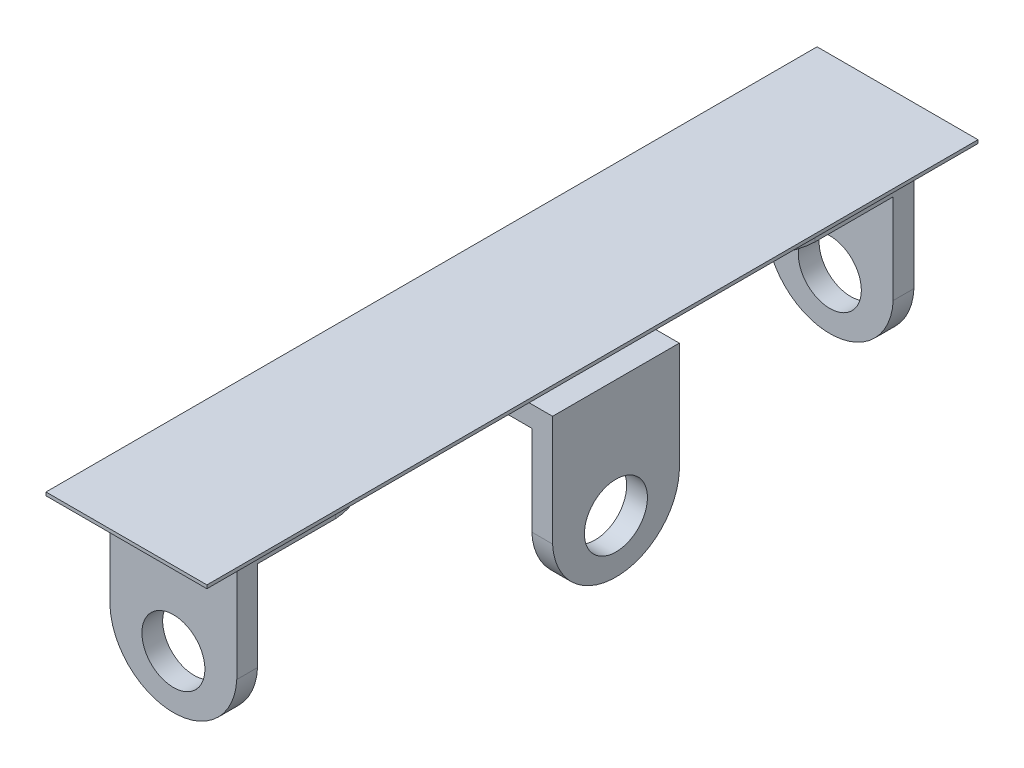
ISO-10303-21;
HEADER;
FILE_DESCRIPTION(('STEP AP214'),'2;1');
FILE_NAME('part.step','',(''),(''),'','','');
FILE_SCHEMA(('AUTOMOTIVE_DESIGN { 1 0 10303 214 1 1 1 1 }'));
ENDSEC;
DATA;
#1=APPLICATION_CONTEXT('core data for automotive mechanical design processes');
#2=APPLICATION_PROTOCOL_DEFINITION('international standard','automotive_design',2000,#1);
#3=PRODUCT_CONTEXT('',#1,'mechanical');
#4=PRODUCT('Part','Part','',(#3));
#5=PRODUCT_RELATED_PRODUCT_CATEGORY('part','',(#4));
#6=PRODUCT_DEFINITION_FORMATION('','',#4);
#7=PRODUCT_DEFINITION_CONTEXT('part definition',#1,'design');
#8=PRODUCT_DEFINITION('design','',#6,#7);
#9=PRODUCT_DEFINITION_SHAPE('','',#8);
#10=(LENGTH_UNIT() NAMED_UNIT(*) SI_UNIT(.MILLI.,.METRE.));
#11=(NAMED_UNIT(*) PLANE_ANGLE_UNIT() SI_UNIT($,.RADIAN.));
#12=(NAMED_UNIT(*) SI_UNIT($,.STERADIAN.) SOLID_ANGLE_UNIT());
#13=UNCERTAINTY_MEASURE_WITH_UNIT(LENGTH_MEASURE(1.E-05),#10,'distance_accuracy_value','');
#14=(GEOMETRIC_REPRESENTATION_CONTEXT(3) GLOBAL_UNCERTAINTY_ASSIGNED_CONTEXT((#13)) GLOBAL_UNIT_ASSIGNED_CONTEXT((#10,
#11,#12)) REPRESENTATION_CONTEXT('',''));
#15=CARTESIAN_POINT('',(0.,0.,0.));
#16=DIRECTION('',(0.,0.,1.));
#17=DIRECTION('',(1.,0.,0.));
#18=AXIS2_PLACEMENT_3D('',#15,#16,#17);
#19=CARTESIAN_POINT('',(0.,0.,0.));
#20=DIRECTION('',(0.,1.,0.));
#21=DIRECTION('',(0.,0.,1.));
#22=AXIS2_PLACEMENT_3D('',#19,#20,#21);
#23=PLANE('',#22);
#24=CARTESIAN_POINT('',(0.,0.,0.));
#25=DIRECTION('',(0.,1.,0.));
#26=DIRECTION('',(0.,0.,1.));
#27=AXIS2_PLACEMENT_3D('',#24,#25,#26);
#28=CIRCLE('',#27,2.4031575);
#29=CARTESIAN_POINT('',(-0.11715749999999,0.,-2.4003));
#30=VERTEX_POINT('',#29);
#31=CARTESIAN_POINT('',(-0.11715749999999,0.,2.4003));
#32=VERTEX_POINT('',#31);
#33=EDGE_CURVE('E324',#30,#32,#28,.T.);
#34=ORIENTED_EDGE('',*,*,#33,.T.);
#35=DIRECTION('',(1.,0.,0.));
#36=VECTOR('',#35,1.);
#37=CARTESIAN_POINT('',(-0.11715749999999,0.,2.4003));
#38=LINE('',#37,#36);
#39=CARTESIAN_POINT('',(3.048,0.,2.4003));
#40=VERTEX_POINT('',#39);
#41=EDGE_CURVE('E339',#32,#40,#38,.T.);
#42=ORIENTED_EDGE('',*,*,#41,.T.);
#43=DIRECTION('',(0.,0.,-1.));
#44=VECTOR('',#43,1.);
#45=CARTESIAN_POINT('',(3.048,0.,14.605));
#46=LINE('',#45,#44);
#47=CARTESIAN_POINT('',(3.048,0.,14.605));
#48=VERTEX_POINT('',#47);
#49=EDGE_CURVE('E365',#48,#40,#46,.T.);
#50=ORIENTED_EDGE('',*,*,#49,.F.);
#51=DIRECTION('',(1.,0.,0.));
#52=VECTOR('',#51,1.);
#53=CARTESIAN_POINT('',(-3.048,0.,14.605));
#54=LINE('',#53,#52);
#55=CARTESIAN_POINT('',(-3.048,0.,14.605));
#56=VERTEX_POINT('',#55);
#57=EDGE_CURVE('E362',#56,#48,#54,.T.);
#58=ORIENTED_EDGE('',*,*,#57,.F.);
#59=DIRECTION('',(0.,0.,1.));
#60=VECTOR('',#59,1.);
#61=CARTESIAN_POINT('',(-3.048,0.,-14.605));
#62=LINE('',#61,#60);
#63=CARTESIAN_POINT('',(-3.048,0.,-14.605));
#64=VERTEX_POINT('',#63);
#65=EDGE_CURVE('E347',#64,#56,#62,.T.);
#66=ORIENTED_EDGE('',*,*,#65,.F.);
#67=DIRECTION('',(-1.,0.,0.));
#68=VECTOR('',#67,1.);
#69=CARTESIAN_POINT('',(3.048,0.,-14.605));
#70=LINE('',#69,#68);
#71=CARTESIAN_POINT('',(3.048,0.,-14.605));
#72=VERTEX_POINT('',#71);
#73=EDGE_CURVE('E353',#72,#64,#70,.T.);
#74=ORIENTED_EDGE('',*,*,#73,.F.);
#75=CARTESIAN_POINT('',(3.048,0.,-2.4003));
#76=VERTEX_POINT('',#75);
#77=EDGE_CURVE('E364',#76,#72,#46,.T.);
#78=ORIENTED_EDGE('',*,*,#77,.F.);
#79=DIRECTION('',(-1.,0.,0.));
#80=VECTOR('',#79,1.);
#81=CARTESIAN_POINT('',(3.5404425,0.,-2.4003));
#82=LINE('',#81,#80);
#83=EDGE_CURVE('E343',#76,#30,#82,.T.);
#84=ORIENTED_EDGE('',*,*,#83,.T.);
#85=EDGE_LOOP('',(#34,#42,#50,#58,#66,#74,#78,#84));
#86=FACE_BOUND('',#85,.T.);
#87=DIRECTION('',(-1.,0.,0.));
#88=VECTOR('',#87,1.);
#89=CARTESIAN_POINT('',(2.4003,0.,12.827));
#90=LINE('',#89,#88);
#91=CARTESIAN_POINT('',(2.4003,0.,12.827));
#92=VERTEX_POINT('',#91);
#93=CARTESIAN_POINT('',(-2.4003,0.,12.827));
#94=VERTEX_POINT('',#93);
#95=EDGE_CURVE('E234',#92,#94,#90,.T.);
#96=ORIENTED_EDGE('',*,*,#95,.F.);
#97=DIRECTION('',(0.,0.,-1.));
#98=VECTOR('',#97,1.);
#99=CARTESIAN_POINT('',(2.4003,0.,12.7352425));
#100=LINE('',#99,#98);
#101=CARTESIAN_POINT('',(2.4003,0.,9.0776425));
#102=VERTEX_POINT('',#101);
#103=EDGE_CURVE('E49',#92,#102,#100,.T.);
#104=ORIENTED_EDGE('',*,*,#103,.T.);
#105=CARTESIAN_POINT('',(0.,0.,9.1948));
#106=DIRECTION('',(0.,1.,0.));
#107=DIRECTION('',(0.,0.,1.));
#108=AXIS2_PLACEMENT_3D('',#105,#106,#107);
#109=CIRCLE('',#108,2.4031575);
#110=CARTESIAN_POINT('',(-2.4003,0.,9.0776425));
#111=VERTEX_POINT('',#110);
#112=EDGE_CURVE('E294',#102,#111,#109,.T.);
#113=ORIENTED_EDGE('',*,*,#112,.T.);
#114=DIRECTION('',(0.,0.,1.));
#115=VECTOR('',#114,1.);
#116=CARTESIAN_POINT('',(-2.4003,0.,9.0776425));
#117=LINE('',#116,#115);
#118=EDGE_CURVE('E56',#111,#94,#117,.T.);
#119=ORIENTED_EDGE('',*,*,#118,.T.);
#120=EDGE_LOOP('',(#96,#104,#113,#119));
#121=FACE_BOUND('',#120,.T.);
#122=DIRECTION('',(-1.,0.,0.));
#123=VECTOR('',#122,1.);
#124=CARTESIAN_POINT('',(2.4003,0.,-12.827));
#125=LINE('',#124,#123);
#126=CARTESIAN_POINT('',(2.4003,0.,-12.827));
#127=VERTEX_POINT('',#126);
#128=CARTESIAN_POINT('',(-2.4003,0.,-12.827));
#129=VERTEX_POINT('',#128);
#130=EDGE_CURVE('E221',#127,#129,#125,.T.);
#131=ORIENTED_EDGE('',*,*,#130,.T.);
#132=DIRECTION('',(0.,0.,1.));
#133=VECTOR('',#132,1.);
#134=CARTESIAN_POINT('',(-2.4003,0.,-12.7352425));
#135=LINE('',#134,#133);
#136=CARTESIAN_POINT('',(-2.4003,0.,-9.0776425));
#137=VERTEX_POINT('',#136);
#138=EDGE_CURVE('E311',#129,#137,#135,.T.);
#139=ORIENTED_EDGE('',*,*,#138,.T.);
#140=CARTESIAN_POINT('',(0.,0.,-9.1948));
#141=DIRECTION('',(0.,1.,0.));
#142=DIRECTION('',(0.,0.,1.));
#143=AXIS2_PLACEMENT_3D('',#140,#141,#142);
#144=CIRCLE('',#143,2.4031575);
#145=CARTESIAN_POINT('',(2.4003,0.,-9.0776425));
#146=VERTEX_POINT('',#145);
#147=EDGE_CURVE('E305',#137,#146,#144,.T.);
#148=ORIENTED_EDGE('',*,*,#147,.T.);
#149=DIRECTION('',(0.,0.,-1.));
#150=VECTOR('',#149,1.);
#151=CARTESIAN_POINT('',(2.4003,0.,-9.0776425));
#152=LINE('',#151,#150);
#153=EDGE_CURVE('E319',#146,#127,#152,.T.);
#154=ORIENTED_EDGE('',*,*,#153,.T.);
#155=EDGE_LOOP('',(#131,#139,#148,#154));
#156=FACE_BOUND('',#155,.T.);
#157=ADVANCED_FACE('F34',(#86,#121,#156),#23,.F.);
#158=CARTESIAN_POINT('',(0.,-0.7874,9.1948));
#159=DIRECTION('',(0.,1.,0.));
#160=DIRECTION('',(0.,0.,1.));
#161=AXIS2_PLACEMENT_3D('',#158,#159,#160);
#162=PLANE('',#161);
#163=CARTESIAN_POINT('',(0.,-0.7874,9.1948000000002));
#164=DIRECTION('',(0.,1.,0.));
#165=DIRECTION('',(0.,0.,1.));
#166=AXIS2_PLACEMENT_3D('',#163,#164,#165);
#167=CIRCLE('',#166,1.6510000000002);
#168=CARTESIAN_POINT('',(0.,-0.7874,10.8458000000004));
#169=VERTEX_POINT('',#168);
#170=EDGE_CURVE('E11',#169,#169,#167,.F.);
#171=ORIENTED_EDGE('',*,*,#170,.F.);
#172=EDGE_LOOP('',(#171));
#173=FACE_BOUND('',#172,.T.);
#174=DIRECTION('',(1.,0.,0.));
#175=VECTOR('',#174,1.);
#176=CARTESIAN_POINT('',(0.,-0.7874,12.0396));
#177=LINE('',#176,#175);
#178=CARTESIAN_POINT('',(-2.4003,-0.7874,12.0396));
#179=VERTEX_POINT('',#178);
#180=CARTESIAN_POINT('',(2.4003,-0.7874,12.0396));
#181=VERTEX_POINT('',#180);
#182=EDGE_CURVE('E384',#179,#181,#177,.T.);
#183=ORIENTED_EDGE('',*,*,#182,.F.);
#184=DIRECTION('',(0.,0.,1.));
#185=VECTOR('',#184,1.);
#186=CARTESIAN_POINT('',(-2.4003,-0.7874,9.0776425));
#187=LINE('',#186,#185);
#188=CARTESIAN_POINT('',(-2.4003,-0.7874,9.0776425));
#189=VERTEX_POINT('',#188);
#190=EDGE_CURVE('E290',#189,#179,#187,.T.);
#191=ORIENTED_EDGE('',*,*,#190,.F.);
#192=CARTESIAN_POINT('',(0.,-0.7874,9.1948));
#193=DIRECTION('',(0.,1.,0.));
#194=DIRECTION('',(0.,0.,1.));
#195=AXIS2_PLACEMENT_3D('',#192,#193,#194);
#196=CIRCLE('',#195,2.4031575);
#197=CARTESIAN_POINT('',(2.4003,-0.7874,9.0776425));
#198=VERTEX_POINT('',#197);
#199=EDGE_CURVE('E296',#198,#189,#196,.T.);
#200=ORIENTED_EDGE('',*,*,#199,.F.);
#201=DIRECTION('',(0.,0.,-1.));
#202=VECTOR('',#201,1.);
#203=CARTESIAN_POINT('',(2.4003,-0.7874,12.7352425));
#204=LINE('',#203,#202);
#205=EDGE_CURVE('E293',#181,#198,#204,.T.);
#206=ORIENTED_EDGE('',*,*,#205,.F.);
#207=EDGE_LOOP('',(#183,#191,#200,#206));
#208=FACE_BOUND('',#207,.T.);
#209=ADVANCED_FACE('F423',(#173,#208),#162,.F.);
#210=CARTESIAN_POINT('',(0.,-0.7874,0.));
#211=DIRECTION('',(0.,1.,0.));
#212=DIRECTION('',(0.,0.,1.));
#213=AXIS2_PLACEMENT_3D('',#210,#211,#212);
#214=PLANE('',#213);
#215=CARTESIAN_POINT('',(-1.21430643318376E-13,-0.7874,0.));
#216=DIRECTION('',(0.,1.,0.));
#217=DIRECTION('',(0.,0.,1.));
#218=AXIS2_PLACEMENT_3D('',#215,#216,#217);
#219=CIRCLE('',#218,1.65100000000012);
#220=CARTESIAN_POINT('',(-1.21430643318376E-13,-0.7874,1.65100000000012));
#221=VERTEX_POINT('',#220);
#222=EDGE_CURVE('E388',#221,#221,#219,.F.);
#223=ORIENTED_EDGE('',*,*,#222,.F.);
#224=EDGE_LOOP('',(#223));
#225=FACE_BOUND('',#224,.T.);
#226=DIRECTION('',(0.,0.,-1.));
#227=VECTOR('',#226,1.);
#228=CARTESIAN_POINT('',(3.1496,-0.7874,0.));
#229=LINE('',#228,#227);
#230=CARTESIAN_POINT('',(3.1496,-0.7874,2.4003));
#231=VERTEX_POINT('',#230);
#232=CARTESIAN_POINT('',(3.1496,-0.7874,-2.4003));
#233=VERTEX_POINT('',#232);
#234=EDGE_CURVE('E381',#231,#233,#229,.T.);
#235=ORIENTED_EDGE('',*,*,#234,.F.);
#236=DIRECTION('',(1.,0.,0.));
#237=VECTOR('',#236,1.);
#238=CARTESIAN_POINT('',(-0.11715749999999,-0.7874,2.4003));
#239=LINE('',#238,#237);
#240=CARTESIAN_POINT('',(-0.11715749999999,-0.7874,2.4003));
#241=VERTEX_POINT('',#240);
#242=EDGE_CURVE('E329',#241,#231,#239,.T.);
#243=ORIENTED_EDGE('',*,*,#242,.F.);
#244=CARTESIAN_POINT('',(0.,-0.7874,0.));
#245=DIRECTION('',(0.,1.,0.));
#246=DIRECTION('',(0.,0.,1.));
#247=AXIS2_PLACEMENT_3D('',#244,#245,#246);
#248=CIRCLE('',#247,2.4031575);
#249=CARTESIAN_POINT('',(-0.11715749999999,-0.7874,-2.4003));
#250=VERTEX_POINT('',#249);
#251=EDGE_CURVE('E326',#250,#241,#248,.T.);
#252=ORIENTED_EDGE('',*,*,#251,.F.);
#253=DIRECTION('',(-1.,0.,0.));
#254=VECTOR('',#253,1.);
#255=CARTESIAN_POINT('',(3.5404425,-0.7874,-2.4003));
#256=LINE('',#255,#254);
#257=EDGE_CURVE('E333',#233,#250,#256,.T.);
#258=ORIENTED_EDGE('',*,*,#257,.F.);
#259=EDGE_LOOP('',(#235,#243,#252,#258));
#260=FACE_BOUND('',#259,.T.);
#261=ADVANCED_FACE('F429',(#225,#260),#214,.F.);
#262=CARTESIAN_POINT('',(-3.048,0.127,-14.605));
#263=DIRECTION('',(1.,0.,0.));
#264=DIRECTION('',(0.,0.,-1.));
#265=AXIS2_PLACEMENT_3D('',#262,#263,#264);
#266=PLANE('',#265);
#267=ORIENTED_EDGE('',*,*,#65,.T.);
#268=DIRECTION('',(0.,-1.,0.));
#269=VECTOR('',#268,1.);
#270=CARTESIAN_POINT('',(-3.048,0.127,14.605));
#271=LINE('',#270,#269);
#272=CARTESIAN_POINT('',(-3.048,0.127,14.605));
#273=VERTEX_POINT('',#272);
#274=EDGE_CURVE('E378',#273,#56,#271,.T.);
#275=ORIENTED_EDGE('',*,*,#274,.F.);
#276=DIRECTION('',(0.,0.,1.));
#277=VECTOR('',#276,1.);
#278=CARTESIAN_POINT('',(-3.048,0.127,-14.605));
#279=LINE('',#278,#277);
#280=CARTESIAN_POINT('',(-3.048,0.127,-14.605));
#281=VERTEX_POINT('',#280);
#282=EDGE_CURVE('E349',#281,#273,#279,.T.);
#283=ORIENTED_EDGE('',*,*,#282,.F.);
#284=DIRECTION('',(0.,-1.,0.));
#285=VECTOR('',#284,1.);
#286=CARTESIAN_POINT('',(-3.048,0.127,-14.605));
#287=LINE('',#286,#285);
#288=EDGE_CURVE('E359',#281,#64,#287,.T.);
#289=ORIENTED_EDGE('',*,*,#288,.T.);
#290=EDGE_LOOP('',(#267,#275,#283,#289));
#291=FACE_BOUND('',#290,.T.);
#292=ADVANCED_FACE('F36',(#291),#266,.F.);
#293=CARTESIAN_POINT('',(-3.048,0.127,14.605));
#294=DIRECTION('',(0.,0.,-1.));
#295=DIRECTION('',(-1.,0.,0.));
#296=AXIS2_PLACEMENT_3D('',#293,#294,#295);
#297=PLANE('',#296);
#298=ORIENTED_EDGE('',*,*,#57,.T.);
#299=DIRECTION('',(0.,-1.,0.));
#300=VECTOR('',#299,1.);
#301=CARTESIAN_POINT('',(3.048,0.127,14.605));
#302=LINE('',#301,#300);
#303=CARTESIAN_POINT('',(3.048,0.127,14.605));
#304=VERTEX_POINT('',#303);
#305=EDGE_CURVE('E375',#304,#48,#302,.T.);
#306=ORIENTED_EDGE('',*,*,#305,.F.);
#307=DIRECTION('',(1.,0.,0.));
#308=VECTOR('',#307,1.);
#309=CARTESIAN_POINT('',(-3.048,0.127,14.605));
#310=LINE('',#309,#308);
#311=EDGE_CURVE('E352',#273,#304,#310,.T.);
#312=ORIENTED_EDGE('',*,*,#311,.F.);
#313=ORIENTED_EDGE('',*,*,#274,.T.);
#314=EDGE_LOOP('',(#298,#306,#312,#313));
#315=FACE_BOUND('',#314,.T.);
#316=ADVANCED_FACE('F442',(#315),#297,.F.);
#317=CARTESIAN_POINT('',(3.048,0.127,14.605));
#318=DIRECTION('',(-1.,0.,0.));
#319=DIRECTION('',(0.,0.,1.));
#320=AXIS2_PLACEMENT_3D('',#317,#318,#319);
#321=PLANE('',#320);
#322=ORIENTED_EDGE('',*,*,#49,.T.);
#323=EDGE_CURVE('E368',#40,#76,#46,.T.);
#324=ORIENTED_EDGE('',*,*,#323,.T.);
#325=ORIENTED_EDGE('',*,*,#77,.T.);
#326=DIRECTION('',(0.,-1.,0.));
#327=VECTOR('',#326,1.);
#328=CARTESIAN_POINT('',(3.048,0.127,-14.605));
#329=LINE('',#328,#327);
#330=CARTESIAN_POINT('',(3.048,0.127,-14.605));
#331=VERTEX_POINT('',#330);
#332=EDGE_CURVE('E372',#331,#72,#329,.T.);
#333=ORIENTED_EDGE('',*,*,#332,.F.);
#334=DIRECTION('',(0.,0.,-1.));
#335=VECTOR('',#334,1.);
#336=CARTESIAN_POINT('',(3.048,0.127,14.605));
#337=LINE('',#336,#335);
#338=EDGE_CURVE('E355',#304,#331,#337,.T.);
#339=ORIENTED_EDGE('',*,*,#338,.F.);
#340=ORIENTED_EDGE('',*,*,#305,.T.);
#341=EDGE_LOOP('',(#322,#324,#325,#333,#339,#340));
#342=FACE_BOUND('',#341,.T.);
#343=ADVANCED_FACE('F439',(#342),#321,.F.);
#344=CARTESIAN_POINT('',(3.048,0.127,-14.605));
#345=DIRECTION('',(0.,0.,1.));
#346=DIRECTION('',(1.,0.,0.));
#347=AXIS2_PLACEMENT_3D('',#344,#345,#346);
#348=PLANE('',#347);
#349=ORIENTED_EDGE('',*,*,#73,.T.);
#350=ORIENTED_EDGE('',*,*,#288,.F.);
#351=DIRECTION('',(-1.,0.,0.));
#352=VECTOR('',#351,1.);
#353=CARTESIAN_POINT('',(3.048,0.127,-14.605));
#354=LINE('',#353,#352);
#355=EDGE_CURVE('E357',#331,#281,#354,.T.);
#356=ORIENTED_EDGE('',*,*,#355,.F.);
#357=ORIENTED_EDGE('',*,*,#332,.T.);
#358=EDGE_LOOP('',(#349,#350,#356,#357));
#359=FACE_BOUND('',#358,.T.);
#360=ADVANCED_FACE('F436',(#359),#348,.F.);
#361=CARTESIAN_POINT('',(0.,0.127,0.));
#362=DIRECTION('',(0.,1.,0.));
#363=DIRECTION('',(0.,0.,1.));
#364=AXIS2_PLACEMENT_3D('',#361,#362,#363);
#365=PLANE('',#364);
#366=ORIENTED_EDGE('',*,*,#282,.T.);
#367=ORIENTED_EDGE('',*,*,#311,.T.);
#368=ORIENTED_EDGE('',*,*,#338,.T.);
#369=ORIENTED_EDGE('',*,*,#355,.T.);
#370=EDGE_LOOP('',(#366,#367,#368,#369));
#371=FACE_BOUND('',#370,.T.);
#372=ADVANCED_FACE('F434',(#371),#365,.T.);
#373=CARTESIAN_POINT('',(0.,0.,0.));
#374=DIRECTION('',(0.,1.,0.));
#375=DIRECTION('',(0.,0.,1.));
#376=AXIS2_PLACEMENT_3D('',#373,#374,#375);
#377=PLANE('',#376);
#378=CARTESIAN_POINT('',(3.937,0.,-2.4003));
#379=VERTEX_POINT('',#378);
#380=EDGE_CURVE('E330',#379,#76,#82,.T.);
#381=ORIENTED_EDGE('',*,*,#380,.T.);
#382=ORIENTED_EDGE('',*,*,#323,.F.);
#383=CARTESIAN_POINT('',(3.937,0.,2.4003));
#384=VERTEX_POINT('',#383);
#385=EDGE_CURVE('E338',#40,#384,#38,.T.);
#386=ORIENTED_EDGE('',*,*,#385,.T.);
#387=DIRECTION('',(0.,0.,1.));
#388=VECTOR('',#387,1.);
#389=CARTESIAN_POINT('',(3.937,0.,-2.4003));
#390=LINE('',#389,#388);
#391=EDGE_CURVE('E264',#379,#384,#390,.T.);
#392=ORIENTED_EDGE('',*,*,#391,.F.);
#393=EDGE_LOOP('',(#381,#382,#386,#392));
#394=FACE_BOUND('',#393,.T.);
#395=ADVANCED_FACE('F466',(#394),#377,.T.);
#396=CARTESIAN_POINT('',(0.,-0.7874,0.));
#397=DIRECTION('',(0.,1.,0.));
#398=DIRECTION('',(0.,0.,1.));
#399=AXIS2_PLACEMENT_3D('',#396,#397,#398);
#400=CYLINDRICAL_SURFACE('',#399,2.4031575);
#401=ORIENTED_EDGE('',*,*,#33,.F.);
#402=DIRECTION('',(0.,1.,0.));
#403=VECTOR('',#402,1.);
#404=CARTESIAN_POINT('',(-0.11715749999999,-0.7874,-2.4003));
#405=LINE('',#404,#403);
#406=EDGE_CURVE('E344',#250,#30,#405,.T.);
#407=ORIENTED_EDGE('',*,*,#406,.F.);
#408=ORIENTED_EDGE('',*,*,#251,.T.);
#409=DIRECTION('',(0.,1.,0.));
#410=VECTOR('',#409,1.);
#411=CARTESIAN_POINT('',(-0.11715749999999,-0.7874,2.4003));
#412=LINE('',#411,#410);
#413=EDGE_CURVE('E335',#241,#32,#412,.T.);
#414=ORIENTED_EDGE('',*,*,#413,.T.);
#415=EDGE_LOOP('',(#401,#407,#408,#414));
#416=FACE_BOUND('',#415,.T.);
#417=ADVANCED_FACE('F478',(#416),#400,.T.);
#418=CARTESIAN_POINT('',(3.5404425,-0.7874,-2.4003));
#419=DIRECTION('',(0.,0.,-1.));
#420=DIRECTION('',(-1.,0.,0.));
#421=AXIS2_PLACEMENT_3D('',#418,#419,#420);
#422=PLANE('',#421);
#423=ORIENTED_EDGE('',*,*,#380,.F.);
#424=DIRECTION('',(0.,1.,0.));
#425=VECTOR('',#424,1.);
#426=CARTESIAN_POINT('',(3.937,-4.191,-2.4003));
#427=LINE('',#426,#425);
#428=CARTESIAN_POINT('',(3.937,-4.191,-2.4003));
#429=VERTEX_POINT('',#428);
#430=EDGE_CURVE('E270',#429,#379,#427,.T.);
#431=ORIENTED_EDGE('',*,*,#430,.F.);
#432=DIRECTION('',(1.,0.,0.));
#433=VECTOR('',#432,1.);
#434=CARTESIAN_POINT('',(3.1496,-4.191,-2.4003));
#435=LINE('',#434,#433);
#436=CARTESIAN_POINT('',(3.1496,-4.191,-2.4003));
#437=VERTEX_POINT('',#436);
#438=EDGE_CURVE('E287',#437,#429,#435,.T.);
#439=ORIENTED_EDGE('',*,*,#438,.F.);
#440=DIRECTION('',(0.,1.,0.));
#441=VECTOR('',#440,1.);
#442=CARTESIAN_POINT('',(3.1496,-4.191,-2.4003));
#443=LINE('',#442,#441);
#444=EDGE_CURVE('E273',#437,#233,#443,.T.);
#445=ORIENTED_EDGE('',*,*,#444,.T.);
#446=ORIENTED_EDGE('',*,*,#257,.T.);
#447=ORIENTED_EDGE('',*,*,#406,.T.);
#448=ORIENTED_EDGE('',*,*,#83,.F.);
#449=EDGE_LOOP('',(#423,#431,#439,#445,#446,#447,#448));
#450=FACE_BOUND('',#449,.T.);
#451=ADVANCED_FACE('F483',(#450),#422,.T.);
#452=CARTESIAN_POINT('',(-0.11715749999999,-0.7874,2.4003));
#453=DIRECTION('',(0.,0.,1.));
#454=DIRECTION('',(1.,0.,0.));
#455=AXIS2_PLACEMENT_3D('',#452,#453,#454);
#456=PLANE('',#455);
#457=DIRECTION('',(0.,-1.,0.));
#458=VECTOR('',#457,1.);
#459=CARTESIAN_POINT('',(3.937,0.,2.4003));
#460=LINE('',#459,#458);
#461=CARTESIAN_POINT('',(3.937,-4.191,2.4003));
#462=VERTEX_POINT('',#461);
#463=EDGE_CURVE('E279',#384,#462,#460,.T.);
#464=ORIENTED_EDGE('',*,*,#463,.F.);
#465=ORIENTED_EDGE('',*,*,#385,.F.);
#466=ORIENTED_EDGE('',*,*,#41,.F.);
#467=ORIENTED_EDGE('',*,*,#413,.F.);
#468=ORIENTED_EDGE('',*,*,#242,.T.);
#469=DIRECTION('',(0.,-1.,0.));
#470=VECTOR('',#469,1.);
#471=CARTESIAN_POINT('',(3.1496,0.,2.4003));
#472=LINE('',#471,#470);
#473=CARTESIAN_POINT('',(3.1496,-4.191,2.4003));
#474=VERTEX_POINT('',#473);
#475=EDGE_CURVE('E267',#231,#474,#472,.T.);
#476=ORIENTED_EDGE('',*,*,#475,.T.);
#477=DIRECTION('',(1.,0.,0.));
#478=VECTOR('',#477,1.);
#479=CARTESIAN_POINT('',(3.1496,-4.191,2.4003));
#480=LINE('',#479,#478);
#481=EDGE_CURVE('E276',#474,#462,#480,.T.);
#482=ORIENTED_EDGE('',*,*,#481,.T.);
#483=EDGE_LOOP('',(#464,#465,#466,#467,#468,#476,#482));
#484=FACE_BOUND('',#483,.T.);
#485=ADVANCED_FACE('F462',(#484),#456,.T.);
#486=CARTESIAN_POINT('',(0.,-0.7874,-9.1948));
#487=DIRECTION('',(0.,1.,0.));
#488=DIRECTION('',(0.,0.,1.));
#489=AXIS2_PLACEMENT_3D('',#486,#487,#488);
#490=CYLINDRICAL_SURFACE('',#489,2.4031575);
#491=ORIENTED_EDGE('',*,*,#147,.F.);
#492=DIRECTION('',(0.,1.,0.));
#493=VECTOR('',#492,1.);
#494=CARTESIAN_POINT('',(-2.4003,-0.7874,-9.0776425));
#495=LINE('',#494,#493);
#496=CARTESIAN_POINT('',(-2.4003,-0.7874,-9.0776425));
#497=VERTEX_POINT('',#496);
#498=EDGE_CURVE('E322',#497,#137,#495,.T.);
#499=ORIENTED_EDGE('',*,*,#498,.F.);
#500=CARTESIAN_POINT('',(0.,-0.7874,-9.1948));
#501=DIRECTION('',(0.,1.,0.));
#502=DIRECTION('',(0.,0.,1.));
#503=AXIS2_PLACEMENT_3D('',#500,#501,#502);
#504=CIRCLE('',#503,2.4031575);
#505=CARTESIAN_POINT('',(2.4003,-0.7874,-9.0776425));
#506=VERTEX_POINT('',#505);
#507=EDGE_CURVE('E307',#497,#506,#504,.T.);
#508=ORIENTED_EDGE('',*,*,#507,.T.);
#509=DIRECTION('',(0.,1.,0.));
#510=VECTOR('',#509,1.);
#511=CARTESIAN_POINT('',(2.4003,-0.7874,-9.0776425));
#512=LINE('',#511,#510);
#513=EDGE_CURVE('E316',#506,#146,#512,.T.);
#514=ORIENTED_EDGE('',*,*,#513,.T.);
#515=EDGE_LOOP('',(#491,#499,#508,#514));
#516=FACE_BOUND('',#515,.T.);
#517=ADVANCED_FACE('F406',(#516),#490,.T.);
#518=CARTESIAN_POINT('',(-2.4003,-0.7874,-12.7352425));
#519=DIRECTION('',(-1.,0.,0.));
#520=DIRECTION('',(0.,0.,1.));
#521=AXIS2_PLACEMENT_3D('',#518,#519,#520);
#522=PLANE('',#521);
#523=ORIENTED_EDGE('',*,*,#498,.T.);
#524=ORIENTED_EDGE('',*,*,#138,.F.);
#525=DIRECTION('',(0.,-1.,0.));
#526=VECTOR('',#525,1.);
#527=CARTESIAN_POINT('',(-2.4003,0.,-12.827));
#528=LINE('',#527,#526);
#529=CARTESIAN_POINT('',(-2.4003,-4.191,-12.827));
#530=VERTEX_POINT('',#529);
#531=EDGE_CURVE('E207',#129,#530,#528,.T.);
#532=ORIENTED_EDGE('',*,*,#531,.T.);
#533=DIRECTION('',(0.,0.,-1.));
#534=VECTOR('',#533,1.);
#535=CARTESIAN_POINT('',(-2.4003,-4.191,-12.0396));
#536=LINE('',#535,#534);
#537=CARTESIAN_POINT('',(-2.4003,-4.191,-12.0396));
#538=VERTEX_POINT('',#537);
#539=EDGE_CURVE('E203',#538,#530,#536,.T.);
#540=ORIENTED_EDGE('',*,*,#539,.F.);
#541=DIRECTION('',(0.,-1.,0.));
#542=VECTOR('',#541,1.);
#543=CARTESIAN_POINT('',(-2.4003,0.,-12.0396));
#544=LINE('',#543,#542);
#545=CARTESIAN_POINT('',(-2.4003,-0.7874,-12.0396));
#546=VERTEX_POINT('',#545);
#547=EDGE_CURVE('E190',#546,#538,#544,.T.);
#548=ORIENTED_EDGE('',*,*,#547,.F.);
#549=DIRECTION('',(0.,0.,1.));
#550=VECTOR('',#549,1.);
#551=CARTESIAN_POINT('',(-2.4003,-0.7874,-12.7352425));
#552=LINE('',#551,#550);
#553=EDGE_CURVE('E314',#546,#497,#552,.T.);
#554=ORIENTED_EDGE('',*,*,#553,.T.);
#555=EDGE_LOOP('',(#523,#524,#532,#540,#548,#554));
#556=FACE_BOUND('',#555,.T.);
#557=ADVANCED_FACE('F205',(#556),#522,.T.);
#558=CARTESIAN_POINT('',(2.4003,-0.7874,-9.0776425));
#559=DIRECTION('',(1.,0.,0.));
#560=DIRECTION('',(0.,0.,-1.));
#561=AXIS2_PLACEMENT_3D('',#558,#559,#560);
#562=PLANE('',#561);
#563=DIRECTION('',(0.,1.,0.));
#564=VECTOR('',#563,1.);
#565=CARTESIAN_POINT('',(2.4003,-4.191,-12.827));
#566=LINE('',#565,#564);
#567=CARTESIAN_POINT('',(2.4003,-4.191,-12.827));
#568=VERTEX_POINT('',#567);
#569=EDGE_CURVE('E200',#568,#127,#566,.T.);
#570=ORIENTED_EDGE('',*,*,#569,.T.);
#571=ORIENTED_EDGE('',*,*,#153,.F.);
#572=ORIENTED_EDGE('',*,*,#513,.F.);
#573=DIRECTION('',(0.,0.,-1.));
#574=VECTOR('',#573,1.);
#575=CARTESIAN_POINT('',(2.4003,-0.7874,-9.0776425));
#576=LINE('',#575,#574);
#577=CARTESIAN_POINT('',(2.4003,-0.7874,-12.0396));
#578=VERTEX_POINT('',#577);
#579=EDGE_CURVE('E310',#506,#578,#576,.T.);
#580=ORIENTED_EDGE('',*,*,#579,.T.);
#581=DIRECTION('',(0.,1.,0.));
#582=VECTOR('',#581,1.);
#583=CARTESIAN_POINT('',(2.4003,-4.191,-12.0396));
#584=LINE('',#583,#582);
#585=CARTESIAN_POINT('',(2.4003,-4.191,-12.0396));
#586=VERTEX_POINT('',#585);
#587=EDGE_CURVE('E216',#586,#578,#584,.T.);
#588=ORIENTED_EDGE('',*,*,#587,.F.);
#589=DIRECTION('',(0.,0.,-1.));
#590=VECTOR('',#589,1.);
#591=CARTESIAN_POINT('',(2.4003,-4.191,-12.0396));
#592=LINE('',#591,#590);
#593=EDGE_CURVE('E211',#586,#568,#592,.T.);
#594=ORIENTED_EDGE('',*,*,#593,.T.);
#595=EDGE_LOOP('',(#570,#571,#572,#580,#588,#594));
#596=FACE_BOUND('',#595,.T.);
#597=ADVANCED_FACE('F399',(#596),#562,.T.);
#598=CARTESIAN_POINT('',(0.,-0.7874,-9.1948));
#599=DIRECTION('',(0.,1.,0.));
#600=DIRECTION('',(0.,0.,1.));
#601=AXIS2_PLACEMENT_3D('',#598,#599,#600);
#602=PLANE('',#601);
#603=CARTESIAN_POINT('',(0.,-0.7874,-9.19479999999902));
#604=DIRECTION('',(0.,1.,0.));
#605=DIRECTION('',(0.,0.,1.));
#606=AXIS2_PLACEMENT_3D('',#603,#604,#605);
#607=CIRCLE('',#606,1.65100000000097);
#608=CARTESIAN_POINT('',(0.,-0.7874,-7.54379999999805));
#609=VERTEX_POINT('',#608);
#610=EDGE_CURVE('E42',#609,#609,#607,.F.);
#611=ORIENTED_EDGE('',*,*,#610,.F.);
#612=EDGE_LOOP('',(#611));
#613=FACE_BOUND('',#612,.T.);
#614=ORIENTED_EDGE('',*,*,#553,.F.);
#615=DIRECTION('',(1.,0.,0.));
#616=VECTOR('',#615,1.);
#617=CARTESIAN_POINT('',(0.,-0.7874,-12.0396));
#618=LINE('',#617,#616);
#619=EDGE_CURVE('E197',#546,#578,#618,.T.);
#620=ORIENTED_EDGE('',*,*,#619,.T.);
#621=ORIENTED_EDGE('',*,*,#579,.F.);
#622=ORIENTED_EDGE('',*,*,#507,.F.);
#623=EDGE_LOOP('',(#614,#620,#621,#622));
#624=FACE_BOUND('',#623,.T.);
#625=ADVANCED_FACE('F395',(#613,#624),#602,.F.);
#626=CARTESIAN_POINT('',(-2.4003,-0.7874,9.0776425));
#627=DIRECTION('',(-1.,0.,0.));
#628=DIRECTION('',(0.,0.,1.));
#629=AXIS2_PLACEMENT_3D('',#626,#627,#628);
#630=PLANE('',#629);
#631=DIRECTION('',(0.,-1.,0.));
#632=VECTOR('',#631,1.);
#633=CARTESIAN_POINT('',(-2.4003,0.,12.827));
#634=LINE('',#633,#632);
#635=CARTESIAN_POINT('',(-2.4003,-4.191,12.827));
#636=VERTEX_POINT('',#635);
#637=EDGE_CURVE('E249',#94,#636,#634,.T.);
#638=ORIENTED_EDGE('',*,*,#637,.F.);
#639=ORIENTED_EDGE('',*,*,#118,.F.);
#640=DIRECTION('',(0.,1.,0.));
#641=VECTOR('',#640,1.);
#642=CARTESIAN_POINT('',(-2.4003,-0.7874,9.0776425));
#643=LINE('',#642,#641);
#644=EDGE_CURVE('E303',#189,#111,#643,.T.);
#645=ORIENTED_EDGE('',*,*,#644,.F.);
#646=ORIENTED_EDGE('',*,*,#190,.T.);
#647=DIRECTION('',(0.,-1.,0.));
#648=VECTOR('',#647,1.);
#649=CARTESIAN_POINT('',(-2.4003,0.,12.0396));
#650=LINE('',#649,#648);
#651=CARTESIAN_POINT('',(-2.4003,-4.191,12.0396));
#652=VERTEX_POINT('',#651);
#653=EDGE_CURVE('E237',#179,#652,#650,.T.);
#654=ORIENTED_EDGE('',*,*,#653,.T.);
#655=DIRECTION('',(0.,0.,1.));
#656=VECTOR('',#655,1.);
#657=CARTESIAN_POINT('',(-2.4003,-4.191,12.0396));
#658=LINE('',#657,#656);
#659=EDGE_CURVE('E246',#652,#636,#658,.T.);
#660=ORIENTED_EDGE('',*,*,#659,.T.);
#661=EDGE_LOOP('',(#638,#639,#645,#646,#654,#660));
#662=FACE_BOUND('',#661,.T.);
#663=ADVANCED_FACE('F398',(#662),#630,.T.);
#664=CARTESIAN_POINT('',(0.,-0.7874,9.1948));
#665=DIRECTION('',(0.,1.,0.));
#666=DIRECTION('',(0.,0.,1.));
#667=AXIS2_PLACEMENT_3D('',#664,#665,#666);
#668=CYLINDRICAL_SURFACE('',#667,2.4031575);
#669=ORIENTED_EDGE('',*,*,#112,.F.);
#670=DIRECTION('',(0.,1.,0.));
#671=VECTOR('',#670,1.);
#672=CARTESIAN_POINT('',(2.4003,-0.7874,9.0776425));
#673=LINE('',#672,#671);
#674=EDGE_CURVE('E299',#198,#102,#673,.T.);
#675=ORIENTED_EDGE('',*,*,#674,.F.);
#676=ORIENTED_EDGE('',*,*,#199,.T.);
#677=ORIENTED_EDGE('',*,*,#644,.T.);
#678=EDGE_LOOP('',(#669,#675,#676,#677));
#679=FACE_BOUND('',#678,.T.);
#680=ADVANCED_FACE('F638',(#679),#668,.T.);
#681=CARTESIAN_POINT('',(2.4003,-0.7874,12.7352425));
#682=DIRECTION('',(1.,0.,0.));
#683=DIRECTION('',(0.,0.,-1.));
#684=AXIS2_PLACEMENT_3D('',#681,#682,#683);
#685=PLANE('',#684);
#686=ORIENTED_EDGE('',*,*,#103,.F.);
#687=DIRECTION('',(0.,1.,0.));
#688=VECTOR('',#687,1.);
#689=CARTESIAN_POINT('',(2.4003,-4.191,12.827));
#690=LINE('',#689,#688);
#691=CARTESIAN_POINT('',(2.4003,-4.191,12.827));
#692=VERTEX_POINT('',#691);
#693=EDGE_CURVE('E240',#692,#92,#690,.T.);
#694=ORIENTED_EDGE('',*,*,#693,.F.);
#695=DIRECTION('',(0.,0.,1.));
#696=VECTOR('',#695,1.);
#697=CARTESIAN_POINT('',(2.4003,-4.191,12.0396));
#698=LINE('',#697,#696);
#699=CARTESIAN_POINT('',(2.4003,-4.191,12.0396));
#700=VERTEX_POINT('',#699);
#701=EDGE_CURVE('E257',#700,#692,#698,.T.);
#702=ORIENTED_EDGE('',*,*,#701,.F.);
#703=DIRECTION('',(0.,1.,0.));
#704=VECTOR('',#703,1.);
#705=CARTESIAN_POINT('',(2.4003,-4.191,12.0396));
#706=LINE('',#705,#704);
#707=EDGE_CURVE('E243',#700,#181,#706,.T.);
#708=ORIENTED_EDGE('',*,*,#707,.T.);
#709=ORIENTED_EDGE('',*,*,#205,.T.);
#710=ORIENTED_EDGE('',*,*,#674,.T.);
#711=EDGE_LOOP('',(#686,#694,#702,#708,#709,#710));
#712=FACE_BOUND('',#711,.T.);
#713=ADVANCED_FACE('F630',(#712),#685,.T.);
#714=CARTESIAN_POINT('',(3.1496,-4.0738425,0.));
#715=DIRECTION('',(1.,0.,0.));
#716=DIRECTION('',(0.,0.,-1.));
#717=AXIS2_PLACEMENT_3D('',#714,#715,#716);
#718=PLANE('',#717);
#719=CARTESIAN_POINT('',(3.1496,-4.4577,0.));
#720=DIRECTION('',(1.,0.,0.));
#721=DIRECTION('',(0.,0.,-1.));
#722=AXIS2_PLACEMENT_3D('',#719,#720,#721);
#723=CIRCLE('',#722,1.1938);
#724=CARTESIAN_POINT('',(3.1496,-4.4577,-1.1938));
#725=VERTEX_POINT('',#724);
#726=EDGE_CURVE('E261',#725,#725,#723,.T.);
#727=ORIENTED_EDGE('',*,*,#726,.T.);
#728=EDGE_LOOP('',(#727));
#729=FACE_BOUND('',#728,.T.);
#730=ORIENTED_EDGE('',*,*,#475,.F.);
#731=ORIENTED_EDGE('',*,*,#234,.T.);
#732=ORIENTED_EDGE('',*,*,#444,.F.);
#733=CARTESIAN_POINT('',(3.1496,-4.0738425,0.));
#734=DIRECTION('',(1.,0.,0.));
#735=DIRECTION('',(0.,0.,-1.));
#736=AXIS2_PLACEMENT_3D('',#733,#734,#735);
#737=CIRCLE('',#736,2.4031575);
#738=EDGE_CURVE('E269',#474,#437,#737,.T.);
#739=ORIENTED_EDGE('',*,*,#738,.F.);
#740=EDGE_LOOP('',(#730,#731,#732,#739));
#741=FACE_BOUND('',#740,.T.);
#742=ADVANCED_FACE('F626',(#729,#741),#718,.F.);
#743=CARTESIAN_POINT('',(3.1496,-4.0738425,0.));
#744=DIRECTION('',(1.,0.,0.));
#745=DIRECTION('',(0.,0.,-1.));
#746=AXIS2_PLACEMENT_3D('',#743,#744,#745);
#747=CYLINDRICAL_SURFACE('',#746,2.4031575);
#748=CARTESIAN_POINT('',(3.937,-4.0738425,0.));
#749=DIRECTION('',(1.,0.,0.));
#750=DIRECTION('',(0.,0.,-1.));
#751=AXIS2_PLACEMENT_3D('',#748,#749,#750);
#752=CIRCLE('',#751,2.4031575);
#753=EDGE_CURVE('E282',#462,#429,#752,.T.);
#754=ORIENTED_EDGE('',*,*,#753,.F.);
#755=ORIENTED_EDGE('',*,*,#481,.F.);
#756=ORIENTED_EDGE('',*,*,#738,.T.);
#757=ORIENTED_EDGE('',*,*,#438,.T.);
#758=EDGE_LOOP('',(#754,#755,#756,#757));
#759=FACE_BOUND('',#758,.T.);
#760=ADVANCED_FACE('F629',(#759),#747,.T.);
#761=CARTESIAN_POINT('',(3.937,-4.0738425,0.));
#762=DIRECTION('',(1.,0.,0.));
#763=DIRECTION('',(0.,0.,-1.));
#764=AXIS2_PLACEMENT_3D('',#761,#762,#763);
#765=PLANE('',#764);
#766=CARTESIAN_POINT('',(3.937,-4.4577,0.));
#767=DIRECTION('',(1.,0.,0.));
#768=DIRECTION('',(0.,0.,-1.));
#769=AXIS2_PLACEMENT_3D('',#766,#767,#768);
#770=CIRCLE('',#769,1.1938);
#771=CARTESIAN_POINT('',(3.937,-4.4577,-1.1938));
#772=VERTEX_POINT('',#771);
#773=EDGE_CURVE('E259',#772,#772,#770,.T.);
#774=ORIENTED_EDGE('',*,*,#773,.F.);
#775=EDGE_LOOP('',(#774));
#776=FACE_BOUND('',#775,.T.);
#777=ORIENTED_EDGE('',*,*,#391,.T.);
#778=ORIENTED_EDGE('',*,*,#463,.T.);
#779=ORIENTED_EDGE('',*,*,#753,.T.);
#780=ORIENTED_EDGE('',*,*,#430,.T.);
#781=EDGE_LOOP('',(#777,#778,#779,#780));
#782=FACE_BOUND('',#781,.T.);
#783=ADVANCED_FACE('F624',(#776,#782),#765,.T.);
#784=CARTESIAN_POINT('',(3.1496,-4.4577,0.));
#785=DIRECTION('',(1.,0.,0.));
#786=DIRECTION('',(0.,0.,-1.));
#787=AXIS2_PLACEMENT_3D('',#784,#785,#786);
#788=CYLINDRICAL_SURFACE('',#787,1.1938);
#789=ORIENTED_EDGE('',*,*,#726,.F.);
#790=EDGE_LOOP('',(#789));
#791=FACE_BOUND('',#790,.T.);
#792=ORIENTED_EDGE('',*,*,#773,.T.);
#793=EDGE_LOOP('',(#792));
#794=FACE_BOUND('',#793,.T.);
#795=ADVANCED_FACE('F614',(#791,#794),#788,.F.);
#796=CARTESIAN_POINT('',(0.,-4.0738425,12.0396));
#797=DIRECTION('',(0.,0.,1.));
#798=DIRECTION('',(1.,0.,0.));
#799=AXIS2_PLACEMENT_3D('',#796,#797,#798);
#800=PLANE('',#799);
#801=CARTESIAN_POINT('',(0.,-4.4577,12.0396));
#802=DIRECTION('',(0.,0.,1.));
#803=DIRECTION('',(1.,0.,0.));
#804=AXIS2_PLACEMENT_3D('',#801,#802,#803);
#805=CIRCLE('',#804,1.1938);
#806=CARTESIAN_POINT('',(1.1938,-4.4577,12.0396));
#807=VERTEX_POINT('',#806);
#808=EDGE_CURVE('E231',#807,#807,#805,.T.);
#809=ORIENTED_EDGE('',*,*,#808,.T.);
#810=EDGE_LOOP('',(#809));
#811=FACE_BOUND('',#810,.T.);
#812=ORIENTED_EDGE('',*,*,#653,.F.);
#813=ORIENTED_EDGE('',*,*,#182,.T.);
#814=ORIENTED_EDGE('',*,*,#707,.F.);
#815=CARTESIAN_POINT('',(0.,-4.0738425,12.0396));
#816=DIRECTION('',(0.,0.,1.));
#817=DIRECTION('',(1.,0.,0.));
#818=AXIS2_PLACEMENT_3D('',#815,#816,#817);
#819=CIRCLE('',#818,2.4031575);
#820=EDGE_CURVE('E239',#652,#700,#819,.T.);
#821=ORIENTED_EDGE('',*,*,#820,.F.);
#822=EDGE_LOOP('',(#812,#813,#814,#821));
#823=FACE_BOUND('',#822,.T.);
#824=ADVANCED_FACE('F610',(#811,#823),#800,.F.);
#825=CARTESIAN_POINT('',(0.,-4.0738425,12.0396));
#826=DIRECTION('',(0.,0.,1.));
#827=DIRECTION('',(1.,0.,0.));
#828=AXIS2_PLACEMENT_3D('',#825,#826,#827);
#829=CYLINDRICAL_SURFACE('',#828,2.4031575);
#830=CARTESIAN_POINT('',(0.,-4.0738425,12.827));
#831=DIRECTION('',(0.,0.,1.));
#832=DIRECTION('',(1.,0.,0.));
#833=AXIS2_PLACEMENT_3D('',#830,#831,#832);
#834=CIRCLE('',#833,2.4031575);
#835=EDGE_CURVE('E252',#636,#692,#834,.T.);
#836=ORIENTED_EDGE('',*,*,#835,.F.);
#837=ORIENTED_EDGE('',*,*,#659,.F.);
#838=ORIENTED_EDGE('',*,*,#820,.T.);
#839=ORIENTED_EDGE('',*,*,#701,.T.);
#840=EDGE_LOOP('',(#836,#837,#838,#839));
#841=FACE_BOUND('',#840,.T.);
#842=ADVANCED_FACE('F613',(#841),#829,.T.);
#843=CARTESIAN_POINT('',(0.,-4.0738425,12.827));
#844=DIRECTION('',(0.,0.,1.));
#845=DIRECTION('',(1.,0.,0.));
#846=AXIS2_PLACEMENT_3D('',#843,#844,#845);
#847=PLANE('',#846);
#848=CARTESIAN_POINT('',(0.,-4.4577,12.827));
#849=DIRECTION('',(0.,0.,1.));
#850=DIRECTION('',(1.,0.,0.));
#851=AXIS2_PLACEMENT_3D('',#848,#849,#850);
#852=CIRCLE('',#851,1.1938);
#853=CARTESIAN_POINT('',(1.1938,-4.4577,12.827));
#854=VERTEX_POINT('',#853);
#855=EDGE_CURVE('E210',#854,#854,#852,.T.);
#856=ORIENTED_EDGE('',*,*,#855,.F.);
#857=EDGE_LOOP('',(#856));
#858=FACE_BOUND('',#857,.T.);
#859=ORIENTED_EDGE('',*,*,#95,.T.);
#860=ORIENTED_EDGE('',*,*,#637,.T.);
#861=ORIENTED_EDGE('',*,*,#835,.T.);
#862=ORIENTED_EDGE('',*,*,#693,.T.);
#863=EDGE_LOOP('',(#859,#860,#861,#862));
#864=FACE_BOUND('',#863,.T.);
#865=ADVANCED_FACE('F608',(#858,#864),#847,.T.);
#866=CARTESIAN_POINT('',(0.,-4.4577,12.0396));
#867=DIRECTION('',(0.,0.,1.));
#868=DIRECTION('',(1.,0.,0.));
#869=AXIS2_PLACEMENT_3D('',#866,#867,#868);
#870=CYLINDRICAL_SURFACE('',#869,1.1938);
#871=ORIENTED_EDGE('',*,*,#808,.F.);
#872=EDGE_LOOP('',(#871));
#873=FACE_BOUND('',#872,.T.);
#874=ORIENTED_EDGE('',*,*,#855,.T.);
#875=EDGE_LOOP('',(#874));
#876=FACE_BOUND('',#875,.T.);
#877=ADVANCED_FACE('F520',(#873,#876),#870,.F.);
#878=CARTESIAN_POINT('',(0.,-4.0738425,-12.0396));
#879=DIRECTION('',(0.,0.,1.));
#880=DIRECTION('',(1.,0.,0.));
#881=AXIS2_PLACEMENT_3D('',#878,#879,#880);
#882=PLANE('',#881);
#883=CARTESIAN_POINT('',(0.,-4.4577,-12.0396));
#884=DIRECTION('',(0.,0.,1.));
#885=DIRECTION('',(1.,0.,0.));
#886=AXIS2_PLACEMENT_3D('',#883,#884,#885);
#887=CIRCLE('',#886,1.1938);
#888=CARTESIAN_POINT('',(1.1938,-4.4577,-12.0396));
#889=VERTEX_POINT('',#888);
#890=EDGE_CURVE('E224',#889,#889,#887,.T.);
#891=ORIENTED_EDGE('',*,*,#890,.F.);
#892=EDGE_LOOP('',(#891));
#893=FACE_BOUND('',#892,.T.);
#894=ORIENTED_EDGE('',*,*,#619,.F.);
#895=ORIENTED_EDGE('',*,*,#547,.T.);
#896=CARTESIAN_POINT('',(0.,-4.0738425,-12.0396));
#897=DIRECTION('',(0.,0.,1.));
#898=DIRECTION('',(1.,0.,0.));
#899=AXIS2_PLACEMENT_3D('',#896,#897,#898);
#900=CIRCLE('',#899,2.4031575);
#901=EDGE_CURVE('E194',#538,#586,#900,.T.);
#902=ORIENTED_EDGE('',*,*,#901,.T.);
#903=ORIENTED_EDGE('',*,*,#587,.T.);
#904=EDGE_LOOP('',(#894,#895,#902,#903));
#905=FACE_BOUND('',#904,.T.);
#906=ADVANCED_FACE('F192',(#893,#905),#882,.T.);
#907=CARTESIAN_POINT('',(0.,-4.0738425,-12.827));
#908=DIRECTION('',(0.,0.,1.));
#909=DIRECTION('',(1.,0.,0.));
#910=AXIS2_PLACEMENT_3D('',#907,#908,#909);
#911=PLANE('',#910);
#912=ORIENTED_EDGE('',*,*,#130,.F.);
#913=ORIENTED_EDGE('',*,*,#569,.F.);
#914=CARTESIAN_POINT('',(0.,-4.0738425,-12.827));
#915=DIRECTION('',(0.,0.,1.));
#916=DIRECTION('',(1.,0.,0.));
#917=AXIS2_PLACEMENT_3D('',#914,#915,#916);
#918=CIRCLE('',#917,2.4031575);
#919=EDGE_CURVE('E226',#530,#568,#918,.T.);
#920=ORIENTED_EDGE('',*,*,#919,.F.);
#921=ORIENTED_EDGE('',*,*,#531,.F.);
#922=EDGE_LOOP('',(#912,#913,#920,#921));
#923=FACE_BOUND('',#922,.T.);
#924=CARTESIAN_POINT('',(0.,-4.4577,-12.827));
#925=DIRECTION('',(0.,0.,1.));
#926=DIRECTION('',(1.,0.,0.));
#927=AXIS2_PLACEMENT_3D('',#924,#925,#926);
#928=CIRCLE('',#927,1.1938);
#929=CARTESIAN_POINT('',(1.1938,-4.4577,-12.827));
#930=VERTEX_POINT('',#929);
#931=EDGE_CURVE('E808',#930,#930,#928,.T.);
#932=ORIENTED_EDGE('',*,*,#931,.T.);
#933=EDGE_LOOP('',(#932));
#934=FACE_BOUND('',#933,.T.);
#935=ADVANCED_FACE('F411',(#923,#934),#911,.F.);
#936=CARTESIAN_POINT('',(0.,-4.0738425,-12.0396));
#937=DIRECTION('',(0.,0.,-1.));
#938=DIRECTION('',(-1.,0.,0.));
#939=AXIS2_PLACEMENT_3D('',#936,#937,#938);
#940=CYLINDRICAL_SURFACE('',#939,2.4031575);
#941=ORIENTED_EDGE('',*,*,#919,.T.);
#942=ORIENTED_EDGE('',*,*,#593,.F.);
#943=ORIENTED_EDGE('',*,*,#901,.F.);
#944=ORIENTED_EDGE('',*,*,#539,.T.);
#945=EDGE_LOOP('',(#941,#942,#943,#944));
#946=FACE_BOUND('',#945,.T.);
#947=ADVANCED_FACE('F213',(#946),#940,.T.);
#948=CARTESIAN_POINT('',(0.,-4.4577,-12.0396));
#949=DIRECTION('',(0.,0.,-1.));
#950=DIRECTION('',(-1.,0.,0.));
#951=AXIS2_PLACEMENT_3D('',#948,#949,#950);
#952=CYLINDRICAL_SURFACE('',#951,1.1938);
#953=ORIENTED_EDGE('',*,*,#890,.T.);
#954=EDGE_LOOP('',(#953));
#955=FACE_BOUND('',#954,.T.);
#956=ORIENTED_EDGE('',*,*,#931,.F.);
#957=EDGE_LOOP('',(#956));
#958=FACE_BOUND('',#957,.T.);
#959=ADVANCED_FACE('F539',(#955,#958),#952,.F.);
#960=CARTESIAN_POINT('',(-1.21430643318376E-13,1.37217727272811,0.));
#961=DIRECTION('',(0.,1.,0.));
#962=DIRECTION('',(1.,0.,0.));
#963=AXIS2_PLACEMENT_3D('',#960,#961,#962);
#964=SPHERICAL_SURFACE('',#963,2.71837727272801);
#965=ORIENTED_EDGE('',*,*,#222,.T.);
#966=EDGE_LOOP('',(#965));
#967=FACE_BOUND('',#966,.T.);
#968=ADVANCED_FACE('F548',(#967),#964,.T.);
#969=CARTESIAN_POINT('',(0.,1.37217727273063,-9.19479999999902));
#970=DIRECTION('',(0.,1.,0.));
#971=DIRECTION('',(0.,0.,-1.));
#972=AXIS2_PLACEMENT_3D('',#969,#970,#971);
#973=SPHERICAL_SURFACE('',#972,2.71837727273053);
#974=ORIENTED_EDGE('',*,*,#610,.T.);
#975=EDGE_LOOP('',(#974));
#976=FACE_BOUND('',#975,.T.);
#977=ADVANCED_FACE('F393',(#976),#973,.T.);
#978=CARTESIAN_POINT('',(0.,1.37217727272834,9.1948000000002));
#979=DIRECTION('',(0.,1.,0.));
#980=DIRECTION('',(0.,0.,-1.));
#981=AXIS2_PLACEMENT_3D('',#978,#979,#980);
#982=SPHERICAL_SURFACE('',#981,2.71837727272824);
#983=ORIENTED_EDGE('',*,*,#170,.T.);
#984=EDGE_LOOP('',(#983));
#985=FACE_BOUND('',#984,.T.);
#986=ADVANCED_FACE('F585',(#985),#982,.T.);
#987=CLOSED_SHELL('',(#157,#209,#261,#292,#316,#343,#360,#372,#395,#417,#451,#485,#517,#557,
#597,#625,#663,#680,#713,#742,#760,#783,#795,#824,#842,#865,#877,#906,#935,#947,#959,#968,#977,#986));
#988=MANIFOLD_SOLID_BREP('B2',#987);
#989=ADVANCED_BREP_SHAPE_REPRESENTATION('',(#18,#988),#14);
#990=SHAPE_DEFINITION_REPRESENTATION(#9,#989);
ENDSEC;
END-ISO-10303-21;
